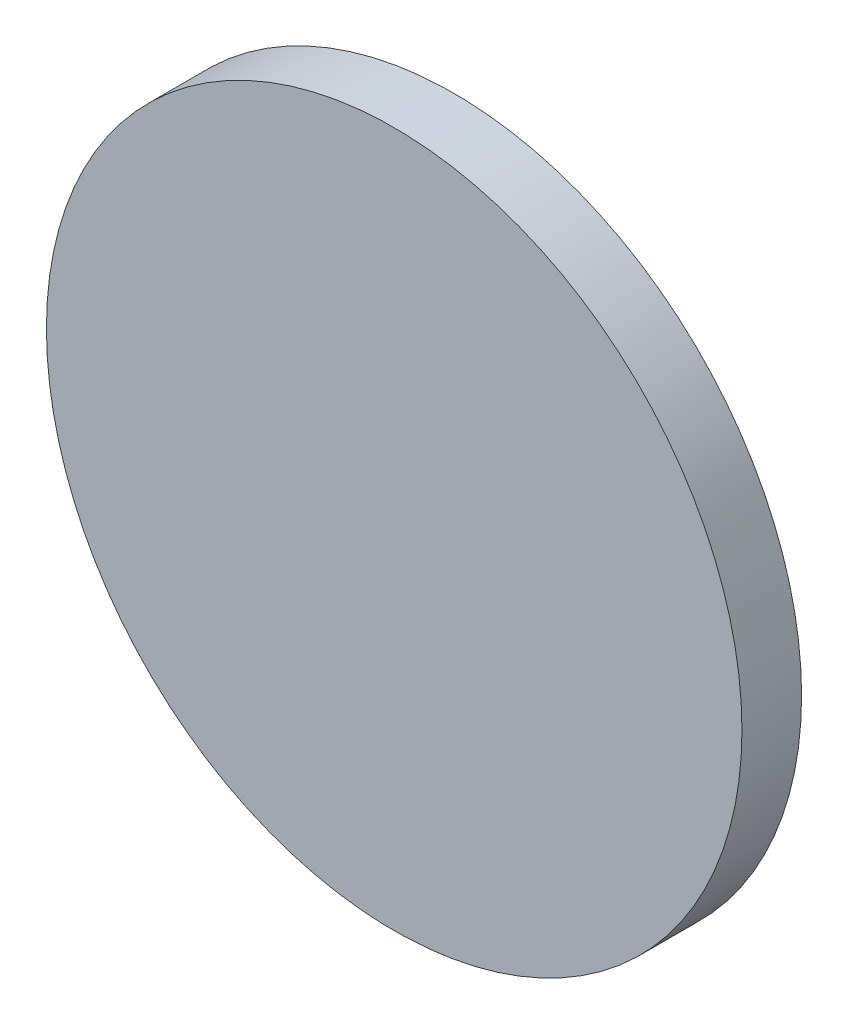
ISO-10303-21;
HEADER;
FILE_DESCRIPTION(('STEP AP214'),'2;1');
FILE_NAME('part.step','',(''),(''),'','','');
FILE_SCHEMA(('AUTOMOTIVE_DESIGN { 1 0 10303 214 1 1 1 1 }'));
ENDSEC;
DATA;
#1=APPLICATION_CONTEXT('core data for automotive mechanical design processes');
#2=APPLICATION_PROTOCOL_DEFINITION('international standard','automotive_design',2000,#1);
#3=PRODUCT_CONTEXT('',#1,'mechanical');
#4=PRODUCT('Part','Part','',(#3));
#5=PRODUCT_RELATED_PRODUCT_CATEGORY('part','',(#4));
#6=PRODUCT_DEFINITION_FORMATION('','',#4);
#7=PRODUCT_DEFINITION_CONTEXT('part definition',#1,'design');
#8=PRODUCT_DEFINITION('design','',#6,#7);
#9=PRODUCT_DEFINITION_SHAPE('','',#8);
#10=(LENGTH_UNIT() NAMED_UNIT(*) SI_UNIT(.MILLI.,.METRE.));
#11=(NAMED_UNIT(*) PLANE_ANGLE_UNIT() SI_UNIT($,.RADIAN.));
#12=(NAMED_UNIT(*) SI_UNIT($,.STERADIAN.) SOLID_ANGLE_UNIT());
#13=UNCERTAINTY_MEASURE_WITH_UNIT(LENGTH_MEASURE(1.E-05),#10,'distance_accuracy_value','');
#14=(GEOMETRIC_REPRESENTATION_CONTEXT(3) GLOBAL_UNCERTAINTY_ASSIGNED_CONTEXT((#13)) GLOBAL_UNIT_ASSIGNED_CONTEXT((#10,
#11,#12)) REPRESENTATION_CONTEXT('',''));
#15=CARTESIAN_POINT('',(0.,0.,0.));
#16=DIRECTION('',(0.,0.,1.));
#17=DIRECTION('',(1.,0.,0.));
#18=AXIS2_PLACEMENT_3D('',#15,#16,#17);
#19=CARTESIAN_POINT('',(10.80008,9.300000014875,0.76487));
#20=DIRECTION('',(0.,0.,-1.));
#21=DIRECTION('',(-1.,0.,0.));
#22=AXIS2_PLACEMENT_3D('',#19,#20,#21);
#23=PLANE('',#22);
#24=CARTESIAN_POINT('',(10.80008,9.300000014875,0.76487));
#25=DIRECTION('',(0.,0.,1.));
#26=DIRECTION('',(1.,0.,0.));
#27=AXIS2_PLACEMENT_3D('',#24,#25,#26);
#28=CIRCLE('',#27,0.200024667);
#29=CARTESIAN_POINT('',(11.000104667,9.300000014875,0.76487));
#30=VERTEX_POINT('',#29);
#31=EDGE_CURVE('E18',#30,#30,#28,.T.);
#32=ORIENTED_EDGE('',*,*,#31,.F.);
#33=EDGE_LOOP('',(#32));
#34=FACE_BOUND('',#33,.T.);
#35=ADVANCED_FACE('F15',(#34),#23,.T.);
#36=CARTESIAN_POINT('',(10.80008,9.300000014875,0.76487));
#37=DIRECTION('',(0.,0.,1.));
#38=DIRECTION('',(1.,0.,0.));
#39=AXIS2_PLACEMENT_3D('',#36,#37,#38);
#40=CYLINDRICAL_SURFACE('',#39,0.200024667);
#41=CARTESIAN_POINT('',(10.80008,9.300000014875,0.79916));
#42=DIRECTION('',(0.,0.,1.));
#43=DIRECTION('',(1.,0.,0.));
#44=AXIS2_PLACEMENT_3D('',#41,#42,#43);
#45=CIRCLE('',#44,0.200024667);
#46=CARTESIAN_POINT('',(11.000104667,9.300000014875,0.79916));
#47=VERTEX_POINT('',#46);
#48=EDGE_CURVE('E10',#47,#47,#45,.T.);
#49=ORIENTED_EDGE('',*,*,#48,.F.);
#50=EDGE_LOOP('',(#49));
#51=FACE_BOUND('',#50,.T.);
#52=ORIENTED_EDGE('',*,*,#31,.T.);
#53=EDGE_LOOP('',(#52));
#54=FACE_BOUND('',#53,.T.);
#55=ADVANCED_FACE('F27',(#51,#54),#40,.T.);
#56=CARTESIAN_POINT('',(10.80008,9.300000014875,0.79916));
#57=DIRECTION('',(0.,0.,1.));
#58=DIRECTION('',(1.,0.,0.));
#59=AXIS2_PLACEMENT_3D('',#56,#57,#58);
#60=PLANE('',#59);
#61=ORIENTED_EDGE('',*,*,#48,.T.);
#62=EDGE_LOOP('',(#61));
#63=FACE_BOUND('',#62,.T.);
#64=ADVANCED_FACE('F34',(#63),#60,.T.);
#65=CLOSED_SHELL('',(#35,#55,#64));
#66=MANIFOLD_SOLID_BREP('B1',#65);
#67=ADVANCED_BREP_SHAPE_REPRESENTATION('',(#18,#66),#14);
#68=SHAPE_DEFINITION_REPRESENTATION(#9,#67);
ENDSEC;
END-ISO-10303-21;
